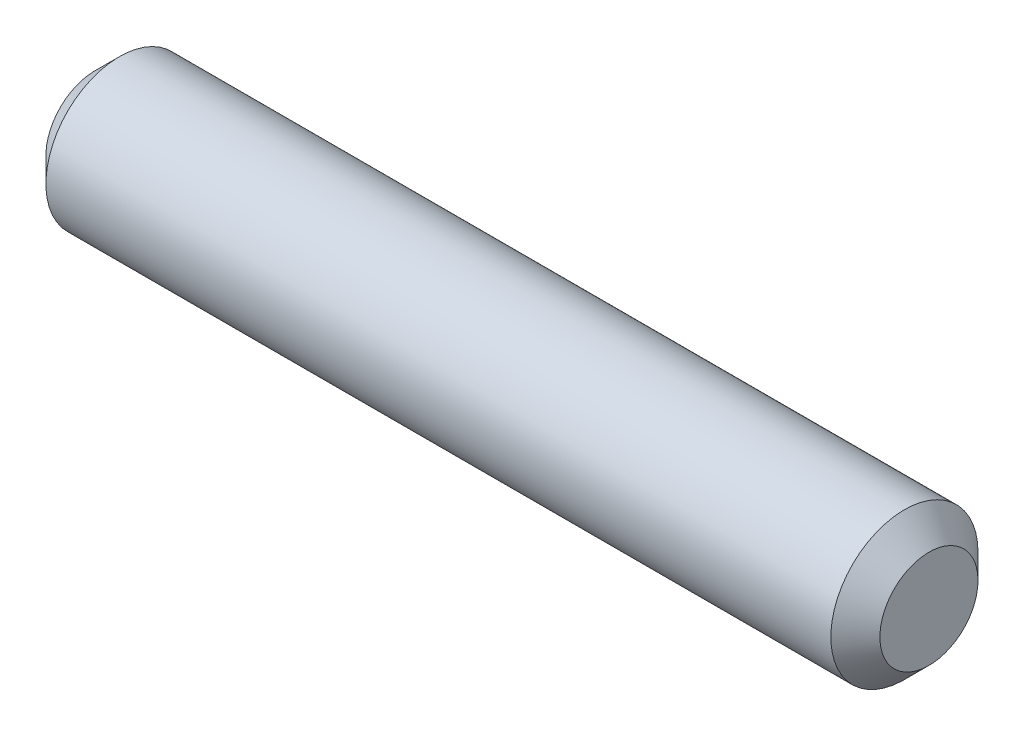
ISO-10303-21;
HEADER;
FILE_DESCRIPTION(('STEP AP214'),'2;1');
FILE_NAME('part.step','',(''),(''),'','','');
FILE_SCHEMA(('AUTOMOTIVE_DESIGN { 1 0 10303 214 1 1 1 1 }'));
ENDSEC;
DATA;
#1=APPLICATION_CONTEXT('core data for automotive mechanical design processes');
#2=APPLICATION_PROTOCOL_DEFINITION('international standard','automotive_design',2000,#1);
#3=PRODUCT_CONTEXT('',#1,'mechanical');
#4=PRODUCT('Part','Part','',(#3));
#5=PRODUCT_RELATED_PRODUCT_CATEGORY('part','',(#4));
#6=PRODUCT_DEFINITION_FORMATION('','',#4);
#7=PRODUCT_DEFINITION_CONTEXT('part definition',#1,'design');
#8=PRODUCT_DEFINITION('design','',#6,#7);
#9=PRODUCT_DEFINITION_SHAPE('','',#8);
#10=(LENGTH_UNIT() NAMED_UNIT(*) SI_UNIT(.MILLI.,.METRE.));
#11=(NAMED_UNIT(*) PLANE_ANGLE_UNIT() SI_UNIT($,.RADIAN.));
#12=(NAMED_UNIT(*) SI_UNIT($,.STERADIAN.) SOLID_ANGLE_UNIT());
#13=UNCERTAINTY_MEASURE_WITH_UNIT(LENGTH_MEASURE(1.E-05),#10,'distance_accuracy_value','');
#14=(GEOMETRIC_REPRESENTATION_CONTEXT(3) GLOBAL_UNCERTAINTY_ASSIGNED_CONTEXT((#13)) GLOBAL_UNIT_ASSIGNED_CONTEXT((#10,
#11,#12)) REPRESENTATION_CONTEXT('',''));
#15=CARTESIAN_POINT('',(0.,0.,0.));
#16=DIRECTION('',(0.,0.,1.));
#17=DIRECTION('',(1.,0.,0.));
#18=AXIS2_PLACEMENT_3D('',#15,#16,#17);
#19=CARTESIAN_POINT('',(8.5,0.,0.));
#20=DIRECTION('',(-1.,0.,0.));
#21=DIRECTION('',(0.,0.,1.));
#22=AXIS2_PLACEMENT_3D('',#19,#20,#21);
#23=CYLINDRICAL_SURFACE('',#22,1.5);
#24=CARTESIAN_POINT('',(-8.,0.,0.));
#25=DIRECTION('',(1.,0.,0.));
#26=DIRECTION('',(0.,0.,-1.));
#27=AXIS2_PLACEMENT_3D('',#24,#25,#26);
#28=CIRCLE('',#27,1.5);
#29=CARTESIAN_POINT('',(-8.,0.,-1.5));
#30=VERTEX_POINT('',#29);
#31=EDGE_CURVE('E43',#30,#30,#28,.T.);
#32=ORIENTED_EDGE('',*,*,#31,.T.);
#33=EDGE_LOOP('',(#32));
#34=FACE_BOUND('',#33,.T.);
#35=CARTESIAN_POINT('',(7.99999999999999,0.,0.));
#36=DIRECTION('',(1.,0.,0.));
#37=DIRECTION('',(0.,0.,-1.));
#38=AXIS2_PLACEMENT_3D('',#35,#36,#37);
#39=CIRCLE('',#38,1.5);
#40=CARTESIAN_POINT('',(7.99999999999999,0.,-1.5));
#41=VERTEX_POINT('',#40);
#42=EDGE_CURVE('E47',#41,#41,#39,.F.);
#43=ORIENTED_EDGE('',*,*,#42,.T.);
#44=EDGE_LOOP('',(#43));
#45=FACE_BOUND('',#44,.T.);
#46=ADVANCED_FACE('F32',(#34,#45),#23,.T.);
#47=CARTESIAN_POINT('',(8.5,0.,0.));
#48=DIRECTION('',(1.,0.,0.));
#49=DIRECTION('',(0.,0.,-1.));
#50=AXIS2_PLACEMENT_3D('',#47,#48,#49);
#51=PLANE('',#50);
#52=CARTESIAN_POINT('',(8.5,0.,0.));
#53=DIRECTION('',(1.,0.,0.));
#54=DIRECTION('',(0.,0.,-1.));
#55=AXIS2_PLACEMENT_3D('',#52,#53,#54);
#56=CIRCLE('',#55,0.999999999999997);
#57=CARTESIAN_POINT('',(8.5,0.,-0.999999999999997));
#58=VERTEX_POINT('',#57);
#59=EDGE_CURVE('E10',#58,#58,#56,.T.);
#60=ORIENTED_EDGE('',*,*,#59,.T.);
#61=EDGE_LOOP('',(#60));
#62=FACE_BOUND('',#61,.T.);
#63=ADVANCED_FACE('F63',(#62),#51,.T.);
#64=CARTESIAN_POINT('',(-8.5,0.,0.));
#65=DIRECTION('',(1.,0.,0.));
#66=DIRECTION('',(0.,0.,-1.));
#67=AXIS2_PLACEMENT_3D('',#64,#65,#66);
#68=PLANE('',#67);
#69=CARTESIAN_POINT('',(-8.5,0.,0.));
#70=DIRECTION('',(1.,0.,0.));
#71=DIRECTION('',(0.,0.,-1.));
#72=AXIS2_PLACEMENT_3D('',#69,#70,#71);
#73=CIRCLE('',#72,0.999999999999996);
#74=CARTESIAN_POINT('',(-8.5,0.,-0.999999999999996));
#75=VERTEX_POINT('',#74);
#76=EDGE_CURVE('E39',#75,#75,#73,.F.);
#77=ORIENTED_EDGE('',*,*,#76,.T.);
#78=EDGE_LOOP('',(#77));
#79=FACE_BOUND('',#78,.T.);
#80=ADVANCED_FACE('F60',(#79),#68,.F.);
#81=CARTESIAN_POINT('',(-8.,0.,0.));
#82=DIRECTION('',(1.,0.,0.));
#83=DIRECTION('',(0.,0.,-1.));
#84=AXIS2_PLACEMENT_3D('',#81,#82,#83);
#85=CONICAL_SURFACE('',#84,1.5,0.785398163397452);
#86=ORIENTED_EDGE('',*,*,#76,.F.);
#87=EDGE_LOOP('',(#86));
#88=FACE_BOUND('',#87,.T.);
#89=ORIENTED_EDGE('',*,*,#31,.F.);
#90=EDGE_LOOP('',(#89));
#91=FACE_BOUND('',#90,.T.);
#92=ADVANCED_FACE('F56',(#88,#91),#85,.T.);
#93=CARTESIAN_POINT('',(8.5,0.,0.));
#94=DIRECTION('',(-1.,0.,0.));
#95=DIRECTION('',(0.,0.,1.));
#96=AXIS2_PLACEMENT_3D('',#93,#94,#95);
#97=CONICAL_SURFACE('',#96,0.999999999999997,0.785398163397445);
#98=ORIENTED_EDGE('',*,*,#42,.F.);
#99=EDGE_LOOP('',(#98));
#100=FACE_BOUND('',#99,.T.);
#101=ORIENTED_EDGE('',*,*,#59,.F.);
#102=EDGE_LOOP('',(#101));
#103=FACE_BOUND('',#102,.T.);
#104=ADVANCED_FACE('F34',(#100,#103),#97,.T.);
#105=CLOSED_SHELL('',(#46,#63,#80,#92,#104));
#106=MANIFOLD_SOLID_BREP('B2',#105);
#107=ADVANCED_BREP_SHAPE_REPRESENTATION('',(#18,#106),#14);
#108=SHAPE_DEFINITION_REPRESENTATION(#9,#107);
ENDSEC;
END-ISO-10303-21;
